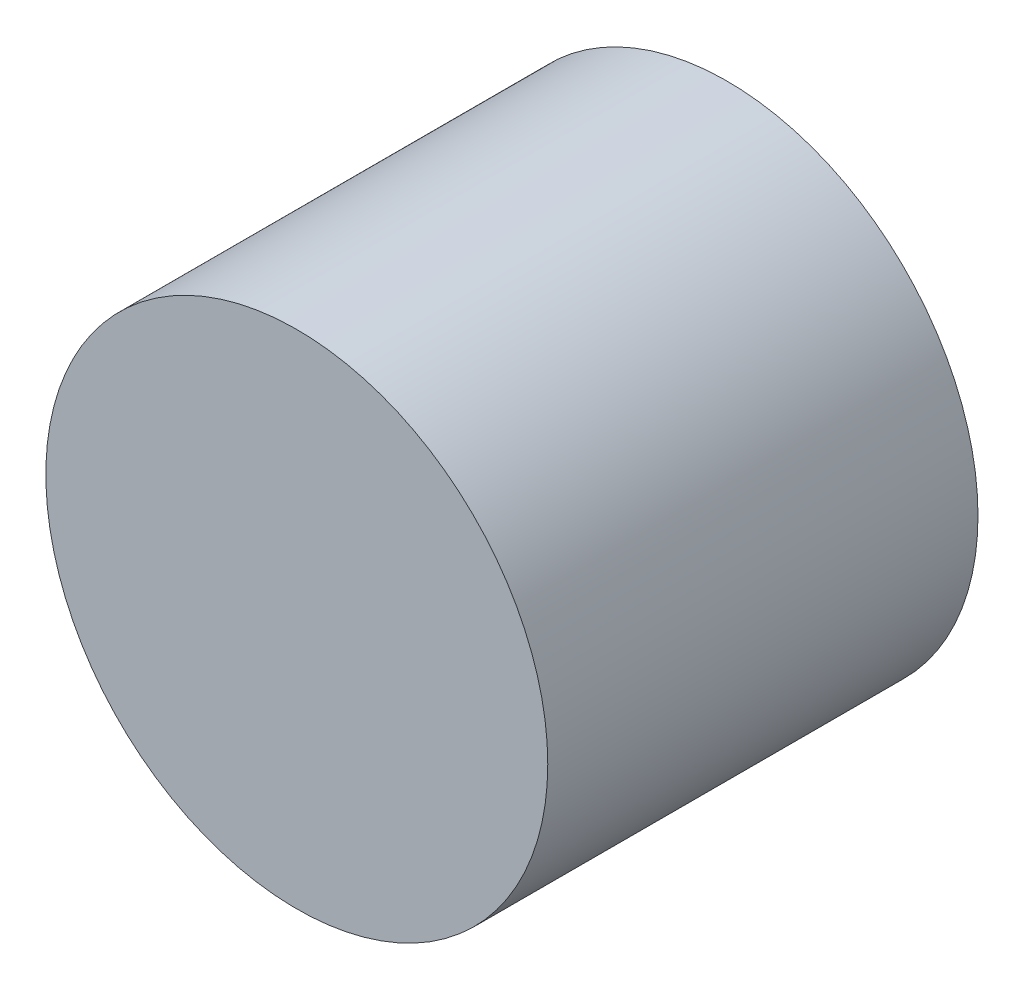
ISO-10303-21;
HEADER;
FILE_DESCRIPTION(('STEP AP214'),'2;1');
FILE_NAME('part.step','',(''),(''),'','','');
FILE_SCHEMA(('AUTOMOTIVE_DESIGN { 1 0 10303 214 1 1 1 1 }'));
ENDSEC;
DATA;
#1=APPLICATION_CONTEXT('core data for automotive mechanical design processes');
#2=APPLICATION_PROTOCOL_DEFINITION('international standard','automotive_design',2000,#1);
#3=PRODUCT_CONTEXT('',#1,'mechanical');
#4=PRODUCT('Part','Part','',(#3));
#5=PRODUCT_RELATED_PRODUCT_CATEGORY('part','',(#4));
#6=PRODUCT_DEFINITION_FORMATION('','',#4);
#7=PRODUCT_DEFINITION_CONTEXT('part definition',#1,'design');
#8=PRODUCT_DEFINITION('design','',#6,#7);
#9=PRODUCT_DEFINITION_SHAPE('','',#8);
#10=(LENGTH_UNIT() NAMED_UNIT(*) SI_UNIT(.MILLI.,.METRE.));
#11=(NAMED_UNIT(*) PLANE_ANGLE_UNIT() SI_UNIT($,.RADIAN.));
#12=(NAMED_UNIT(*) SI_UNIT($,.STERADIAN.) SOLID_ANGLE_UNIT());
#13=UNCERTAINTY_MEASURE_WITH_UNIT(LENGTH_MEASURE(1.E-05),#10,'distance_accuracy_value','');
#14=(GEOMETRIC_REPRESENTATION_CONTEXT(3) GLOBAL_UNCERTAINTY_ASSIGNED_CONTEXT((#13)) GLOBAL_UNIT_ASSIGNED_CONTEXT((#10,
#11,#12)) REPRESENTATION_CONTEXT('',''));
#15=CARTESIAN_POINT('',(0.,0.,0.));
#16=DIRECTION('',(0.,0.,1.));
#17=DIRECTION('',(1.,0.,0.));
#18=AXIS2_PLACEMENT_3D('',#15,#16,#17);
#19=CARTESIAN_POINT('',(0.,0.,3.));
#20=DIRECTION('',(0.,0.,-1.));
#21=DIRECTION('',(-1.,0.,0.));
#22=AXIS2_PLACEMENT_3D('',#19,#20,#21);
#23=CYLINDRICAL_SURFACE('',#22,1.75);
#24=CARTESIAN_POINT('',(0.,0.,3.));
#25=DIRECTION('',(0.,0.,1.));
#26=DIRECTION('',(1.,0.,0.));
#27=AXIS2_PLACEMENT_3D('',#24,#25,#26);
#28=CIRCLE('',#27,1.75);
#29=CARTESIAN_POINT('',(1.75,0.,3.));
#30=VERTEX_POINT('',#29);
#31=EDGE_CURVE('E10',#30,#30,#28,.T.);
#32=ORIENTED_EDGE('',*,*,#31,.F.);
#33=EDGE_LOOP('',(#32));
#34=FACE_BOUND('',#33,.T.);
#35=CARTESIAN_POINT('',(0.,0.,0.));
#36=DIRECTION('',(0.,0.,1.));
#37=DIRECTION('',(1.,0.,0.));
#38=AXIS2_PLACEMENT_3D('',#35,#36,#37);
#39=CIRCLE('',#38,1.75);
#40=CARTESIAN_POINT('',(1.75,0.,0.));
#41=VERTEX_POINT('',#40);
#42=EDGE_CURVE('E40',#41,#41,#39,.T.);
#43=ORIENTED_EDGE('',*,*,#42,.T.);
#44=EDGE_LOOP('',(#43));
#45=FACE_BOUND('',#44,.T.);
#46=ADVANCED_FACE('F37',(#34,#45),#23,.T.);
#47=CARTESIAN_POINT('',(0.,0.,3.));
#48=DIRECTION('',(0.,0.,1.));
#49=DIRECTION('',(1.,0.,0.));
#50=AXIS2_PLACEMENT_3D('',#47,#48,#49);
#51=PLANE('',#50);
#52=ORIENTED_EDGE('',*,*,#31,.T.);
#53=EDGE_LOOP('',(#52));
#54=FACE_BOUND('',#53,.T.);
#55=ADVANCED_FACE('F54',(#54),#51,.T.);
#56=CARTESIAN_POINT('',(0.,0.,0.));
#57=DIRECTION('',(0.,0.,1.));
#58=DIRECTION('',(1.,0.,0.));
#59=AXIS2_PLACEMENT_3D('',#56,#57,#58);
#60=PLANE('',#59);
#61=ORIENTED_EDGE('',*,*,#42,.F.);
#62=EDGE_LOOP('',(#61));
#63=FACE_BOUND('',#62,.T.);
#64=ADVANCED_FACE('F52',(#63),#60,.F.);
#65=CLOSED_SHELL('',(#46,#55,#64));
#66=MANIFOLD_SOLID_BREP('B2',#65);
#67=ADVANCED_BREP_SHAPE_REPRESENTATION('',(#18,#66),#14);
#68=SHAPE_DEFINITION_REPRESENTATION(#9,#67);
ENDSEC;
END-ISO-10303-21;
